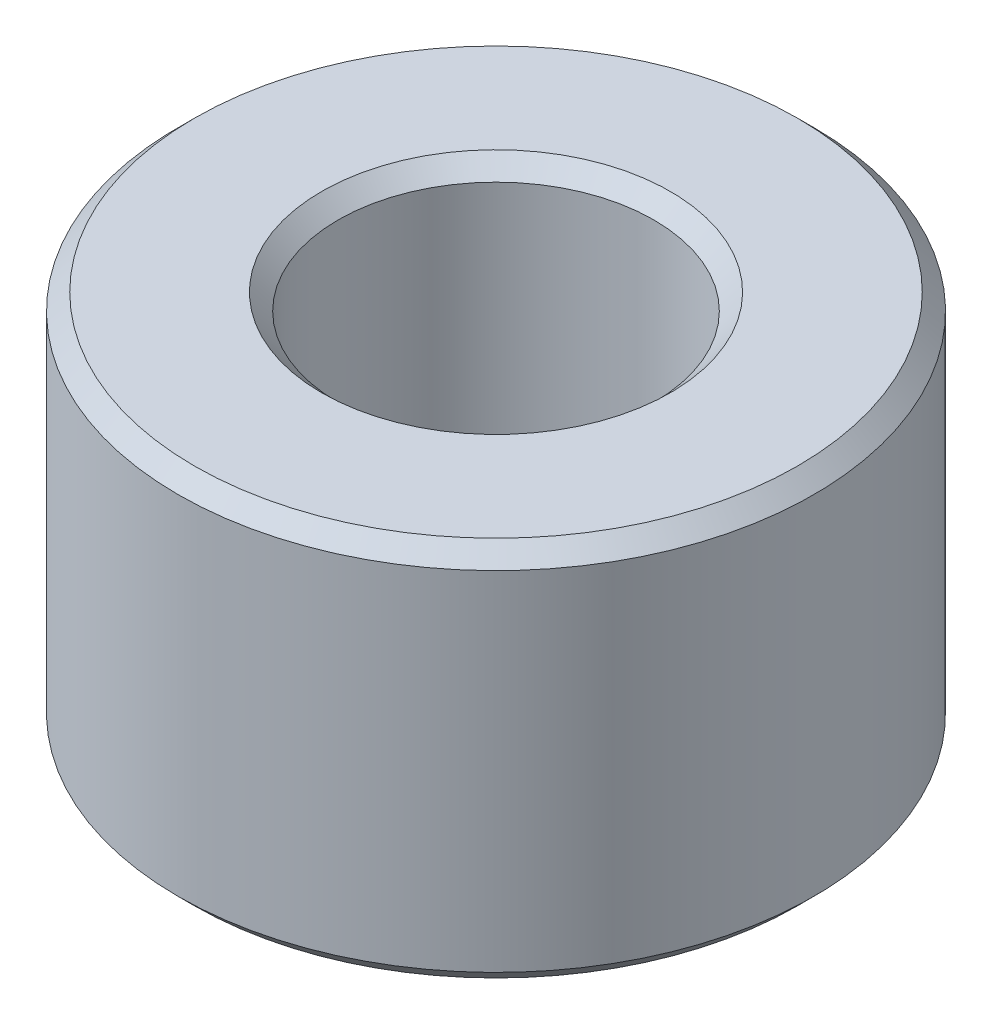
ISO-10303-21;
HEADER;
FILE_DESCRIPTION(('STEP AP214'),'2;1');
FILE_NAME('part.step','',(''),(''),'','','');
FILE_SCHEMA(('AUTOMOTIVE_DESIGN { 1 0 10303 214 1 1 1 1 }'));
ENDSEC;
DATA;
#1=APPLICATION_CONTEXT('core data for automotive mechanical design processes');
#2=APPLICATION_PROTOCOL_DEFINITION('international standard','automotive_design',2000,#1);
#3=PRODUCT_CONTEXT('',#1,'mechanical');
#4=PRODUCT('Part','Part','',(#3));
#5=PRODUCT_RELATED_PRODUCT_CATEGORY('part','',(#4));
#6=PRODUCT_DEFINITION_FORMATION('','',#4);
#7=PRODUCT_DEFINITION_CONTEXT('part definition',#1,'design');
#8=PRODUCT_DEFINITION('design','',#6,#7);
#9=PRODUCT_DEFINITION_SHAPE('','',#8);
#10=(LENGTH_UNIT() NAMED_UNIT(*) SI_UNIT(.MILLI.,.METRE.));
#11=(NAMED_UNIT(*) PLANE_ANGLE_UNIT() SI_UNIT($,.RADIAN.));
#12=(NAMED_UNIT(*) SI_UNIT($,.STERADIAN.) SOLID_ANGLE_UNIT());
#13=UNCERTAINTY_MEASURE_WITH_UNIT(LENGTH_MEASURE(1.E-05),#10,'distance_accuracy_value','');
#14=(GEOMETRIC_REPRESENTATION_CONTEXT(3) GLOBAL_UNCERTAINTY_ASSIGNED_CONTEXT((#13)) GLOBAL_UNIT_ASSIGNED_CONTEXT((#10,
#11,#12)) REPRESENTATION_CONTEXT('',''));
#15=CARTESIAN_POINT('',(0.,0.,0.));
#16=DIRECTION('',(0.,0.,1.));
#17=DIRECTION('',(1.,0.,0.));
#18=AXIS2_PLACEMENT_3D('',#15,#16,#17);
#19=CARTESIAN_POINT('',(0.,65.8999758698143,0.));
#20=DIRECTION('',(0.,-1.,0.));
#21=DIRECTION('',(0.,0.,-1.));
#22=AXIS2_PLACEMENT_3D('',#19,#20,#21);
#23=CYLINDRICAL_SURFACE('',#22,55.);
#24=CARTESIAN_POINT('',(0.,2.84565166869974,0.));
#25=DIRECTION('',(0.,1.,0.));
#26=DIRECTION('',(0.,0.,1.));
#27=AXIS2_PLACEMENT_3D('',#24,#25,#26);
#28=CIRCLE('',#27,55.);
#29=CARTESIAN_POINT('',(0.,2.84565166869974,55.));
#30=VERTEX_POINT('',#29);
#31=EDGE_CURVE('E10',#30,#30,#28,.T.);
#32=ORIENTED_EDGE('',*,*,#31,.T.);
#33=EDGE_LOOP('',(#32));
#34=FACE_BOUND('',#33,.T.);
#35=CARTESIAN_POINT('',(0.,63.0543242011146,0.));
#36=DIRECTION('',(0.,1.,0.));
#37=DIRECTION('',(0.,0.,1.));
#38=AXIS2_PLACEMENT_3D('',#35,#36,#37);
#39=CIRCLE('',#38,55.);
#40=CARTESIAN_POINT('',(0.,63.0543242011146,55.));
#41=VERTEX_POINT('',#40);
#42=EDGE_CURVE('E50',#41,#41,#39,.F.);
#43=ORIENTED_EDGE('',*,*,#42,.T.);
#44=EDGE_LOOP('',(#43));
#45=FACE_BOUND('',#44,.T.);
#46=ADVANCED_FACE('F39',(#34,#45),#23,.T.);
#47=CARTESIAN_POINT('',(0.,65.8999758698143,0.));
#48=DIRECTION('',(0.,1.,0.));
#49=DIRECTION('',(0.,0.,1.));
#50=AXIS2_PLACEMENT_3D('',#47,#48,#49);
#51=PLANE('',#50);
#52=CARTESIAN_POINT('',(0.,65.8999758698143,0.));
#53=DIRECTION('',(0.,1.,0.));
#54=DIRECTION('',(0.,0.,1.));
#55=AXIS2_PLACEMENT_3D('',#52,#53,#54);
#56=CIRCLE('',#55,30.1731263768653);
#57=CARTESIAN_POINT('',(0.,65.8999758698143,30.1731263768653));
#58=VERTEX_POINT('',#57);
#59=EDGE_CURVE('E58',#58,#58,#56,.F.);
#60=ORIENTED_EDGE('',*,*,#59,.T.);
#61=EDGE_LOOP('',(#60));
#62=FACE_BOUND('',#61,.T.);
#63=CARTESIAN_POINT('',(0.,65.8999758698143,0.));
#64=DIRECTION('',(0.,1.,0.));
#65=DIRECTION('',(0.,0.,1.));
#66=AXIS2_PLACEMENT_3D('',#63,#64,#65);
#67=CIRCLE('',#66,52.1543483313002);
#68=CARTESIAN_POINT('',(0.,65.8999758698143,52.1543483313002));
#69=VERTEX_POINT('',#68);
#70=EDGE_CURVE('E61',#69,#69,#67,.T.);
#71=ORIENTED_EDGE('',*,*,#70,.T.);
#72=EDGE_LOOP('',(#71));
#73=FACE_BOUND('',#72,.T.);
#74=ADVANCED_FACE('F88',(#62,#73),#51,.T.);
#75=CARTESIAN_POINT('',(0.,0.,0.));
#76=DIRECTION('',(0.,1.,0.));
#77=DIRECTION('',(0.,0.,1.));
#78=AXIS2_PLACEMENT_3D('',#75,#76,#77);
#79=PLANE('',#78);
#80=CARTESIAN_POINT('',(0.,0.,0.));
#81=DIRECTION('',(0.,1.,0.));
#82=DIRECTION('',(0.,0.,1.));
#83=AXIS2_PLACEMENT_3D('',#80,#81,#82);
#84=CIRCLE('',#83,30.1731263768653);
#85=CARTESIAN_POINT('',(0.,0.,-30.1731263768653));
#86=VERTEX_POINT('',#85);
#87=EDGE_CURVE('E51',#86,#86,#84,.T.);
#88=ORIENTED_EDGE('',*,*,#87,.T.);
#89=EDGE_LOOP('',(#88));
#90=FACE_BOUND('',#89,.T.);
#91=CARTESIAN_POINT('',(0.,0.,0.));
#92=DIRECTION('',(0.,1.,0.));
#93=DIRECTION('',(0.,0.,1.));
#94=AXIS2_PLACEMENT_3D('',#91,#92,#93);
#95=CIRCLE('',#94,52.1543483313002);
#96=CARTESIAN_POINT('',(0.,0.,52.1543483313002));
#97=VERTEX_POINT('',#96);
#98=EDGE_CURVE('E54',#97,#97,#95,.F.);
#99=ORIENTED_EDGE('',*,*,#98,.T.);
#100=EDGE_LOOP('',(#99));
#101=FACE_BOUND('',#100,.T.);
#102=ADVANCED_FACE('F83',(#90,#101),#79,.F.);
#103=CARTESIAN_POINT('',(0.,65.8999758698143,0.));
#104=DIRECTION('',(0.,-1.,0.));
#105=DIRECTION('',(0.,0.,-1.));
#106=AXIS2_PLACEMENT_3D('',#103,#104,#105);
#107=CYLINDRICAL_SURFACE('',#106,27.3274747081656);
#108=CARTESIAN_POINT('',(0.,63.0543242011146,0.));
#109=DIRECTION('',(0.,1.,0.));
#110=DIRECTION('',(0.,0.,1.));
#111=AXIS2_PLACEMENT_3D('',#108,#109,#110);
#112=CIRCLE('',#111,27.3274747081656);
#113=CARTESIAN_POINT('',(0.,63.0543242011146,27.3274747081656));
#114=VERTEX_POINT('',#113);
#115=EDGE_CURVE('E67',#114,#114,#112,.T.);
#116=ORIENTED_EDGE('',*,*,#115,.T.);
#117=EDGE_LOOP('',(#116));
#118=FACE_BOUND('',#117,.T.);
#119=CARTESIAN_POINT('',(0.,2.84565166869977,0.));
#120=DIRECTION('',(0.,1.,0.));
#121=DIRECTION('',(0.,0.,1.));
#122=AXIS2_PLACEMENT_3D('',#119,#120,#121);
#123=CIRCLE('',#122,27.3274747081656);
#124=CARTESIAN_POINT('',(0.,2.84565166869977,-27.3274747081656));
#125=VERTEX_POINT('',#124);
#126=EDGE_CURVE('E69',#125,#125,#123,.F.);
#127=ORIENTED_EDGE('',*,*,#126,.T.);
#128=EDGE_LOOP('',(#127));
#129=FACE_BOUND('',#128,.T.);
#130=ADVANCED_FACE('F71',(#118,#129),#107,.F.);
#131=CARTESIAN_POINT('',(0.,63.0543242011146,0.));
#132=DIRECTION('',(0.,1.,0.));
#133=DIRECTION('',(0.,0.,1.));
#134=AXIS2_PLACEMENT_3D('',#131,#132,#133);
#135=CONICAL_SURFACE('',#134,27.3274747081656,0.785398163397455);
#136=ORIENTED_EDGE('',*,*,#59,.F.);
#137=EDGE_LOOP('',(#136));
#138=FACE_BOUND('',#137,.T.);
#139=ORIENTED_EDGE('',*,*,#115,.F.);
#140=EDGE_LOOP('',(#139));
#141=FACE_BOUND('',#140,.T.);
#142=ADVANCED_FACE('F77',(#138,#141),#135,.F.);
#143=CARTESIAN_POINT('',(0.,0.,0.));
#144=DIRECTION('',(0.,-1.,0.));
#145=DIRECTION('',(0.,0.,-1.));
#146=AXIS2_PLACEMENT_3D('',#143,#144,#145);
#147=CONICAL_SURFACE('',#146,30.1731263768653,0.785398163397442);
#148=CARTESIAN_POINT('',(0.,2.84565166869977,-27.3274747081656));
#149=CARTESIAN_POINT('',(0.,2.81600946381748,-27.3571169130479));
#150=CARTESIAN_POINT('',(0.,2.78636725893519,-27.3867591179301));
#151=CARTESIAN_POINT('',(0.,2.72708284917061,-27.4460435276947));
#152=CARTESIAN_POINT('',(0.,2.69744064428832,-27.475685732577));
#153=CARTESIAN_POINT('',(0.,2.63815623452374,-27.5349701423416));
#154=CARTESIAN_POINT('',(0.,2.60851402964145,-27.5646123472239));
#155=CARTESIAN_POINT('',(0.,2.54922961987687,-27.6238967569885));
#156=CARTESIAN_POINT('',(0.,2.51958741499459,-27.6535389618707));
#157=CARTESIAN_POINT('',(0.,2.46030300523001,-27.7128233716353));
#158=CARTESIAN_POINT('',(0.,2.43066080034772,-27.7424655765176));
#159=CARTESIAN_POINT('',(0.,2.37137639058314,-27.8017499862822));
#160=CARTESIAN_POINT('',(0.,2.34173418570085,-27.8313921911645));
#161=CARTESIAN_POINT('',(0.,2.28244977593627,-27.890676600929));
#162=CARTESIAN_POINT('',(0.,2.25280757105398,-27.9203188058113));
#163=CARTESIAN_POINT('',(0.,2.1935231612894,-27.9796032155759));
#164=CARTESIAN_POINT('',(0.,2.16388095640711,-28.0092454204582));
#165=CARTESIAN_POINT('',(0.,2.10459654664254,-28.0685298302228));
#166=CARTESIAN_POINT('',(0.,2.07495434176025,-28.0981720351051));
#167=CARTESIAN_POINT('',(0.,2.01566993199567,-28.1574564448696));
#168=CARTESIAN_POINT('',(0.,1.98602772711338,-28.1870986497519));
#169=CARTESIAN_POINT('',(0.,1.9267433173488,-28.2463830595165));
#170=CARTESIAN_POINT('',(0.,1.89710111246651,-28.2760252643988));
#171=CARTESIAN_POINT('',(0.,1.83781670270193,-28.3353096741634));
#172=CARTESIAN_POINT('',(0.,1.80817449781964,-28.3649518790457));
#173=CARTESIAN_POINT('',(0.,1.74889008805506,-28.4242362888102));
#174=CARTESIAN_POINT('',(0.,1.71924788317278,-28.4538784936925));
#175=CARTESIAN_POINT('',(0.,1.6599634734082,-28.5131629034571));
#176=CARTESIAN_POINT('',(0.,1.63032126852591,-28.5428051083394));
#177=CARTESIAN_POINT('',(0.,1.57103685876133,-28.602089518104));
#178=CARTESIAN_POINT('',(0.,1.54139465387904,-28.6317317229863));
#179=CARTESIAN_POINT('',(0.,1.48211024411446,-28.6910161327508));
#180=CARTESIAN_POINT('',(0.,1.45246803923217,-28.7206583376331));
#181=CARTESIAN_POINT('',(0.,1.39318362946759,-28.7799427473977));
#182=CARTESIAN_POINT('',(0.,1.36354142458531,-28.80958495228));
#183=CARTESIAN_POINT('',(0.,1.30425701482073,-28.8688693620446));
#184=CARTESIAN_POINT('',(0.,1.27461480993844,-28.8985115669269));
#185=CARTESIAN_POINT('',(0.,1.21533040017386,-28.9577959766914));
#186=CARTESIAN_POINT('',(0.,1.18568819529157,-28.9874381815737));
#187=CARTESIAN_POINT('',(0.,1.12640378552699,-29.0467225913383));
#188=CARTESIAN_POINT('',(0.,1.0967615806447,-29.0763647962206));
#189=CARTESIAN_POINT('',(0.,1.03747717088012,-29.1356492059852));
#190=CARTESIAN_POINT('',(0.,1.00783496599783,-29.1652914108675));
#191=CARTESIAN_POINT('',(0.,0.948550556233255,-29.224575820632));
#192=CARTESIAN_POINT('',(0.,0.918908351350966,-29.2542180255143));
#193=CARTESIAN_POINT('',(0.,0.859623941586388,-29.3135024352789));
#194=CARTESIAN_POINT('',(0.,0.829981736704098,-29.3431446401612));
#195=CARTESIAN_POINT('',(0.,0.77069732693952,-29.4024290499258));
#196=CARTESIAN_POINT('',(0.,0.741055122057231,-29.4320712548081));
#197=CARTESIAN_POINT('',(0.,0.681770712292653,-29.4913556645727));
#198=CARTESIAN_POINT('',(0.,0.652128507410363,-29.5209978694549));
#199=CARTESIAN_POINT('',(0.,0.592844097645784,-29.5802822792195));
#200=CARTESIAN_POINT('',(0.,0.563201892763495,-29.6099244841018));
#201=CARTESIAN_POINT('',(0.,0.503917482998917,-29.6692088938664));
#202=CARTESIAN_POINT('',(0.,0.474275278116628,-29.6988510987487));
#203=CARTESIAN_POINT('',(0.,0.41499086835205,-29.7581355085132));
#204=CARTESIAN_POINT('',(0.,0.38534866346976,-29.7877777133955));
#205=CARTESIAN_POINT('',(0.,0.326064253705181,-29.8470621231601));
#206=CARTESIAN_POINT('',(0.,0.296422048822892,-29.8767043280424));
#207=CARTESIAN_POINT('',(0.,0.237137639058314,-29.935988737807));
#208=CARTESIAN_POINT('',(0.,0.207495434176025,-29.9656309426893));
#209=CARTESIAN_POINT('',(0.,0.148211024411446,-30.0249153524538));
#210=CARTESIAN_POINT('',(0.,0.118568819529157,-30.0545575573361));
#211=CARTESIAN_POINT('',(0.,0.0592844097645779,-30.1138419671007));
#212=CARTESIAN_POINT('',(0.,0.0296422048822884,-30.143484171983));
#213=CARTESIAN_POINT('',(0.,0.,-30.1731263768653));
#214=B_SPLINE_CURVE_WITH_KNOTS('',3,(#148,#149,#150,#151,#152,#153,#154,#155,#156,#157,#158,
#159,#160,#161,#162,#163,#164,#165,#166,#167,#168,#169,#170,#171,#172,#173,#174,#175,#176,#177,
#178,#179,#180,#181,#182,#183,#184,#185,#186,#187,#188,#189,#190,#191,#192,#193,#194,#195,#196,
#197,#198,#199,#200,#201,#202,#203,#204,#205,#206,#207,#208,#209,#210,#211,#212,#213),
.UNSPECIFIED.,.F.,.F.,(4,2,2,2,2,2,2,2,2,2,2,2,2,2,2,2,2,2,2,2,2,2,2,2,2,2,2,2,2,2,2,2,4),(0.,
0.125761224489526,0.25152244897905,0.377283673468576,0.503044897958102,0.628806122447626,
0.754567346937153,0.880328571426679,1.0060897959162,1.13185102040573,1.25761224489526,
1.38337346938478,1.50913469387431,1.63489591836383,1.76065714285336,1.88641836734288,
2.01217959183241,2.13794081632193,2.26370204081146,2.38946326530098,2.51522448979051,
2.64098571428003,2.76674693876956,2.89250816325909,3.01826938774861,3.14403061223814,
3.26979183672766,3.39555306121719,3.52131428570671,3.64707551019624,3.77283673468576,
3.89859795917529,4.02435918366481),.UNSPECIFIED.);
#215=EDGE_CURVE('BSEAM73',#125,#86,#214,.T.);
#216=ORIENTED_EDGE('',*,*,#126,.F.);
#217=ORIENTED_EDGE('',*,*,#87,.F.);
#218=ORIENTED_EDGE('',*,*,#215,.T.);
#219=ORIENTED_EDGE('',*,*,#215,.F.);
#220=EDGE_LOOP('',(#216,#218,#217,#219));
#221=FACE_BOUND('',#220,.T.);
#222=ADVANCED_FACE('F73',(#221),#147,.F.);
#223=CARTESIAN_POINT('',(0.,2.84565166869974,0.));
#224=DIRECTION('',(0.,1.,0.));
#225=DIRECTION('',(0.,0.,1.));
#226=AXIS2_PLACEMENT_3D('',#223,#224,#225);
#227=CONICAL_SURFACE('',#226,55.,0.785398163397454);
#228=ORIENTED_EDGE('',*,*,#98,.F.);
#229=EDGE_LOOP('',(#228));
#230=FACE_BOUND('',#229,.T.);
#231=ORIENTED_EDGE('',*,*,#31,.F.);
#232=EDGE_LOOP('',(#231));
#233=FACE_BOUND('',#232,.T.);
#234=ADVANCED_FACE('F76',(#230,#233),#227,.T.);
#235=CARTESIAN_POINT('',(0.,65.8999758698143,0.));
#236=DIRECTION('',(0.,-1.,0.));
#237=DIRECTION('',(0.,0.,-1.));
#238=AXIS2_PLACEMENT_3D('',#235,#236,#237);
#239=CONICAL_SURFACE('',#238,52.1543483313002,0.785398163397448);
#240=ORIENTED_EDGE('',*,*,#42,.F.);
#241=EDGE_LOOP('',(#240));
#242=FACE_BOUND('',#241,.T.);
#243=ORIENTED_EDGE('',*,*,#70,.F.);
#244=EDGE_LOOP('',(#243));
#245=FACE_BOUND('',#244,.T.);
#246=ADVANCED_FACE('F45',(#242,#245),#239,.T.);
#247=CLOSED_SHELL('',(#46,#74,#102,#130,#142,#222,#234,#246));
#248=MANIFOLD_SOLID_BREP('B2',#247);
#249=ADVANCED_BREP_SHAPE_REPRESENTATION('',(#18,#248),#14);
#250=SHAPE_DEFINITION_REPRESENTATION(#9,#249);
ENDSEC;
END-ISO-10303-21;
